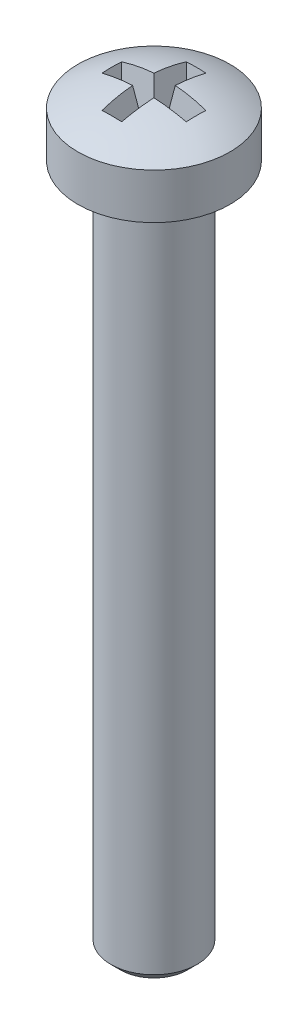
ISO-10303-21;
HEADER;
FILE_DESCRIPTION(('STEP AP214'),'2;1');
FILE_NAME('part.step','',(''),(''),'','','');
FILE_SCHEMA(('AUTOMOTIVE_DESIGN { 1 0 10303 214 1 1 1 1 }'));
ENDSEC;
DATA;
#1=APPLICATION_CONTEXT('core data for automotive mechanical design processes');
#2=APPLICATION_PROTOCOL_DEFINITION('international standard','automotive_design',2000,#1);
#3=PRODUCT_CONTEXT('',#1,'mechanical');
#4=PRODUCT('Part','Part','',(#3));
#5=PRODUCT_RELATED_PRODUCT_CATEGORY('part','',(#4));
#6=PRODUCT_DEFINITION_FORMATION('','',#4);
#7=PRODUCT_DEFINITION_CONTEXT('part definition',#1,'design');
#8=PRODUCT_DEFINITION('design','',#6,#7);
#9=PRODUCT_DEFINITION_SHAPE('','',#8);
#10=(LENGTH_UNIT() NAMED_UNIT(*) SI_UNIT(.MILLI.,.METRE.));
#11=(NAMED_UNIT(*) PLANE_ANGLE_UNIT() SI_UNIT($,.RADIAN.));
#12=(NAMED_UNIT(*) SI_UNIT($,.STERADIAN.) SOLID_ANGLE_UNIT());
#13=UNCERTAINTY_MEASURE_WITH_UNIT(LENGTH_MEASURE(1.E-05),#10,'distance_accuracy_value','');
#14=(GEOMETRIC_REPRESENTATION_CONTEXT(3) GLOBAL_UNCERTAINTY_ASSIGNED_CONTEXT((#13)) GLOBAL_UNIT_ASSIGNED_CONTEXT((#10,
#11,#12)) REPRESENTATION_CONTEXT('',''));
#15=CARTESIAN_POINT('',(0.,0.,0.));
#16=DIRECTION('',(0.,0.,1.));
#17=DIRECTION('',(1.,0.,0.));
#18=AXIS2_PLACEMENT_3D('',#15,#16,#17);
#19=CARTESIAN_POINT('',(5.7875,12.8,-2.45200000000001));
#20=DIRECTION('',(0.,-0.149438132473599,0.988771077936042));
#21=DIRECTION('',(-1.,0.,0.));
#22=AXIS2_PLACEMENT_3D('',#19,#20,#21);
#23=PLANE('',#22);
#24=CARTESIAN_POINT('',(6.00000000000001,9.74139917848052,-2.91426230211361));
#25=DIRECTION('',(0.,-0.149438132473599,0.988771077936042));
#26=DIRECTION('',(0.,0.988771077936042,0.149438132473599));
#27=AXIS2_PLACEMENT_3D('',#24,#25,#26);
#28=CIRCLE('',#27,2.97426048310416);
#29=CARTESIAN_POINT('',(6.19376146307785,12.6760147557736,-2.47073853692217));
#30=VERTEX_POINT('',#29);
#31=CARTESIAN_POINT('',(5.80623853692216,12.6760147557736,-2.47073853692217));
#32=VERTEX_POINT('',#31);
#33=EDGE_CURVE('E34',#30,#32,#28,.T.);
#34=ORIENTED_EDGE('',*,*,#33,.F.);
#35=DIRECTION('',(-0.14779696163853,-0.977912120929502,-0.14779696163853));
#36=VECTOR('',#35,1.);
#37=CARTESIAN_POINT('',(6.20785816235272,12.7692868564527,-2.45664183764729));
#38=LINE('',#37,#36);
#39=CARTESIAN_POINT('',(6.01602421652422,11.5,-2.6484757834758));
#40=VERTEX_POINT('',#39);
#41=EDGE_CURVE('E11',#30,#40,#38,.T.);
#42=ORIENTED_EDGE('',*,*,#41,.T.);
#43=DIRECTION('',(1.,0.,0.));
#44=VECTOR('',#43,1.);
#45=CARTESIAN_POINT('',(6.2125,11.5,-2.6484757834758));
#46=LINE('',#45,#44);
#47=CARTESIAN_POINT('',(5.98397578347579,11.5,-2.6484757834758));
#48=VERTEX_POINT('',#47);
#49=EDGE_CURVE('E168',#48,#40,#46,.T.);
#50=ORIENTED_EDGE('',*,*,#49,.F.);
#51=DIRECTION('',(0.14779696163853,-0.977912120929502,-0.14779696163853));
#52=VECTOR('',#51,1.);
#53=CARTESIAN_POINT('',(5.79446275647093,12.753930284679,-2.45896275647092));
#54=LINE('',#53,#52);
#55=EDGE_CURVE('E26',#32,#48,#54,.T.);
#56=ORIENTED_EDGE('',*,*,#55,.F.);
#57=EDGE_LOOP('',(#34,#42,#50,#56));
#58=FACE_BOUND('',#57,.T.);
#59=ADVANCED_FACE('F16',(#58),#23,.F.);
#60=CARTESIAN_POINT('',(5.7875,12.8,-3.08949999999999));
#61=DIRECTION('',(-0.988771077936042,-0.149438132473599,0.));
#62=DIRECTION('',(0.,0.,-1.));
#63=AXIS2_PLACEMENT_3D('',#60,#61,#62);
#64=PLANE('',#63);
#65=CARTESIAN_POINT('',(6.2355258080224,9.83559624435382,-3.302));
#66=DIRECTION('',(-0.988771077936042,-0.149438132473599,0.));
#67=DIRECTION('',(-0.149438132473599,0.988771077936042,0.));
#68=AXIS2_PLACEMENT_3D('',#65,#66,#67);
#69=CIRCLE('',#68,2.99052846519529);
#70=CARTESIAN_POINT('',(5.78973284200671,12.7852261965451,-3.09173284200673));
#71=VERTEX_POINT('',#70);
#72=EDGE_CURVE('E194',#32,#71,#69,.T.);
#73=ORIENTED_EDGE('',*,*,#72,.F.);
#74=ORIENTED_EDGE('',*,*,#55,.T.);
#75=DIRECTION('',(0.,0.,1.));
#76=VECTOR('',#75,1.);
#77=CARTESIAN_POINT('',(5.98397578347579,11.5,-2.45200000000001));
#78=LINE('',#77,#76);
#79=CARTESIAN_POINT('',(5.98397578347579,11.5,-3.28597578347578));
#80=VERTEX_POINT('',#79);
#81=EDGE_CURVE('E90',#80,#48,#78,.T.);
#82=ORIENTED_EDGE('',*,*,#81,.F.);
#83=DIRECTION('',(0.14779696163853,-0.977912120929502,-0.14779696163853));
#84=VECTOR('',#83,1.);
#85=CARTESIAN_POINT('',(5.78053724352907,12.846069715321,-3.08253724352908));
#86=LINE('',#85,#84);
#87=EDGE_CURVE('E218',#71,#80,#86,.T.);
#88=ORIENTED_EDGE('',*,*,#87,.F.);
#89=EDGE_LOOP('',(#73,#74,#82,#88));
#90=FACE_BOUND('',#89,.T.);
#91=ADVANCED_FACE('F244',(#90),#64,.F.);
#92=CARTESIAN_POINT('',(5.15,12.8,-3.08949999999999));
#93=DIRECTION('',(0.,-0.149438132473599,0.988771077936042));
#94=DIRECTION('',(-1.,0.,0.));
#95=AXIS2_PLACEMENT_3D('',#92,#93,#94);
#96=PLANE('',#95);
#97=CARTESIAN_POINT('',(6.00000000000001,9.83559624435382,-3.53752580802241));
#98=DIRECTION('',(0.,-0.149438132473599,0.988771077936042));
#99=DIRECTION('',(0.,0.988771077936042,0.149438132473599));
#100=AXIS2_PLACEMENT_3D('',#97,#98,#99);
#101=CIRCLE('',#100,2.99052846519529);
#102=CARTESIAN_POINT('',(5.16873853692217,12.6760147557736,-3.10823853692216));
#103=VERTEX_POINT('',#102);
#104=EDGE_CURVE('E191',#71,#103,#101,.T.);
#105=ORIENTED_EDGE('',*,*,#104,.F.);
#106=ORIENTED_EDGE('',*,*,#87,.T.);
#107=DIRECTION('',(1.,0.,0.));
#108=VECTOR('',#107,1.);
#109=CARTESIAN_POINT('',(5.7875,11.5,-3.28597578347578));
#110=LINE('',#109,#108);
#111=CARTESIAN_POINT('',(5.34647578347577,11.5,-3.28597578347578));
#112=VERTEX_POINT('',#111);
#113=EDGE_CURVE('E180',#112,#80,#110,.T.);
#114=ORIENTED_EDGE('',*,*,#113,.F.);
#115=DIRECTION('',(0.14779696163853,-0.977912120929502,-0.14779696163853));
#116=VECTOR('',#115,1.);
#117=CARTESIAN_POINT('',(5.15464183764729,12.7692868564527,-3.09414183764728));
#118=LINE('',#117,#116);
#119=EDGE_CURVE('E183',#103,#112,#118,.T.);
#120=ORIENTED_EDGE('',*,*,#119,.F.);
#121=EDGE_LOOP('',(#105,#106,#114,#120));
#122=FACE_BOUND('',#121,.T.);
#123=ADVANCED_FACE('F18',(#122),#96,.F.);
#124=CARTESIAN_POINT('',(5.15,12.8,-3.5145));
#125=DIRECTION('',(-0.988771077936042,-0.149438132473599,0.));
#126=DIRECTION('',(0.,0.,-1.));
#127=AXIS2_PLACEMENT_3D('',#124,#125,#126);
#128=PLANE('',#127);
#129=CARTESIAN_POINT('',(5.61226230211363,9.74139917848052,-3.302));
#130=DIRECTION('',(-0.988771077936042,-0.149438132473599,0.));
#131=DIRECTION('',(-0.149438132473599,0.988771077936042,0.));
#132=AXIS2_PLACEMENT_3D('',#129,#130,#131);
#133=CIRCLE('',#132,2.97426048310416);
#134=CARTESIAN_POINT('',(5.16873853692217,12.6760147557736,-3.49576146307784));
#135=VERTEX_POINT('',#134);
#136=EDGE_CURVE('E187',#103,#135,#133,.T.);
#137=ORIENTED_EDGE('',*,*,#136,.F.);
#138=ORIENTED_EDGE('',*,*,#119,.T.);
#139=DIRECTION('',(0.,0.,1.));
#140=VECTOR('',#139,1.);
#141=CARTESIAN_POINT('',(5.34647578347577,11.5,-3.08949999999999));
#142=LINE('',#141,#140);
#143=CARTESIAN_POINT('',(5.34647578347577,11.5,-3.31802421652422));
#144=VERTEX_POINT('',#143);
#145=EDGE_CURVE('E210',#144,#112,#142,.T.);
#146=ORIENTED_EDGE('',*,*,#145,.F.);
#147=DIRECTION('',(0.14779696163853,-0.977912120929502,0.14779696163853));
#148=VECTOR('',#147,1.);
#149=CARTESIAN_POINT('',(5.15696275647093,12.753930284679,-3.50753724352906));
#150=LINE('',#149,#148);
#151=EDGE_CURVE('E176',#135,#144,#150,.T.);
#152=ORIENTED_EDGE('',*,*,#151,.F.);
#153=EDGE_LOOP('',(#137,#138,#146,#152));
#154=FACE_BOUND('',#153,.T.);
#155=ADVANCED_FACE('F314',(#154),#128,.F.);
#156=CARTESIAN_POINT('',(5.7875,12.8,-3.5145));
#157=DIRECTION('',(0.,-0.149438132473599,-0.988771077936042));
#158=DIRECTION('',(1.,0.,0.));
#159=AXIS2_PLACEMENT_3D('',#156,#157,#158);
#160=PLANE('',#159);
#161=CARTESIAN_POINT('',(6.00000000000001,9.83559624435382,-3.06647419197759));
#162=DIRECTION('',(0.,-0.149438132473599,-0.988771077936042));
#163=DIRECTION('',(0.,-0.988771077936042,0.149438132473599));
#164=AXIS2_PLACEMENT_3D('',#161,#162,#163);
#165=CIRCLE('',#164,2.99052846519529);
#166=CARTESIAN_POINT('',(5.78973284200671,12.7852261965451,-3.5122671579933));
#167=VERTEX_POINT('',#166);
#168=EDGE_CURVE('E184',#135,#167,#165,.T.);
#169=ORIENTED_EDGE('',*,*,#168,.F.);
#170=ORIENTED_EDGE('',*,*,#151,.T.);
#171=DIRECTION('',(-1.,0.,0.));
#172=VECTOR('',#171,1.);
#173=CARTESIAN_POINT('',(5.15,11.5,-3.31802421652422));
#174=LINE('',#173,#172);
#175=CARTESIAN_POINT('',(5.98397578347579,11.5,-3.31802421652422));
#176=VERTEX_POINT('',#175);
#177=EDGE_CURVE('E209',#176,#144,#174,.T.);
#178=ORIENTED_EDGE('',*,*,#177,.F.);
#179=DIRECTION('',(0.14779696163853,-0.977912120929502,0.14779696163853));
#180=VECTOR('',#179,1.);
#181=CARTESIAN_POINT('',(5.78053724352907,12.846069715321,-3.52146275647092));
#182=LINE('',#181,#180);
#183=EDGE_CURVE('E174',#167,#176,#182,.T.);
#184=ORIENTED_EDGE('',*,*,#183,.F.);
#185=EDGE_LOOP('',(#169,#170,#178,#184));
#186=FACE_BOUND('',#185,.T.);
#187=ADVANCED_FACE('F277',(#186),#160,.F.);
#188=CARTESIAN_POINT('',(5.7875,12.8,-4.15199999999999));
#189=DIRECTION('',(-0.988771077936042,-0.149438132473599,0.));
#190=DIRECTION('',(0.,0.,-1.));
#191=AXIS2_PLACEMENT_3D('',#188,#189,#190);
#192=PLANE('',#191);
#193=CARTESIAN_POINT('',(6.2355258080224,9.83559624435382,-3.302));
#194=DIRECTION('',(-0.988771077936042,-0.149438132473599,0.));
#195=DIRECTION('',(-0.149438132473599,0.988771077936042,0.));
#196=AXIS2_PLACEMENT_3D('',#193,#194,#195);
#197=CIRCLE('',#196,2.99052846519529);
#198=CARTESIAN_POINT('',(5.80623853692216,12.6760147557736,-4.13326146307783));
#199=VERTEX_POINT('',#198);
#200=EDGE_CURVE('E188',#167,#199,#197,.T.);
#201=ORIENTED_EDGE('',*,*,#200,.F.);
#202=ORIENTED_EDGE('',*,*,#183,.T.);
#203=DIRECTION('',(0.,0.,1.));
#204=VECTOR('',#203,1.);
#205=CARTESIAN_POINT('',(5.98397578347579,11.5,-3.5145));
#206=LINE('',#205,#204);
#207=CARTESIAN_POINT('',(5.98397578347579,11.5,-3.9555242165242));
#208=VERTEX_POINT('',#207);
#209=EDGE_CURVE('E206',#208,#176,#206,.T.);
#210=ORIENTED_EDGE('',*,*,#209,.F.);
#211=DIRECTION('',(0.14779696163853,-0.977912120929502,0.14779696163853));
#212=VECTOR('',#211,1.);
#213=CARTESIAN_POINT('',(5.79214183764729,12.7692868564527,-4.1473581623527));
#214=LINE('',#213,#212);
#215=EDGE_CURVE('E177',#199,#208,#214,.T.);
#216=ORIENTED_EDGE('',*,*,#215,.F.);
#217=EDGE_LOOP('',(#201,#202,#210,#216));
#218=FACE_BOUND('',#217,.T.);
#219=ADVANCED_FACE('F273',(#218),#192,.F.);
#220=CARTESIAN_POINT('',(6.2125,12.8,-4.15199999999999));
#221=DIRECTION('',(0.,-0.149438132473599,-0.988771077936042));
#222=DIRECTION('',(1.,0.,0.));
#223=AXIS2_PLACEMENT_3D('',#220,#221,#222);
#224=PLANE('',#223);
#225=CARTESIAN_POINT('',(6.00000000000001,9.74139917848052,-3.68973769788639));
#226=DIRECTION('',(0.,-0.149438132473599,-0.988771077936042));
#227=DIRECTION('',(0.,-0.988771077936042,0.149438132473599));
#228=AXIS2_PLACEMENT_3D('',#225,#226,#227);
#229=CIRCLE('',#228,2.97426048310416);
#230=CARTESIAN_POINT('',(6.19376146307785,12.6760147557736,-4.13326146307783));
#231=VERTEX_POINT('',#230);
#232=EDGE_CURVE('E152',#199,#231,#229,.T.);
#233=ORIENTED_EDGE('',*,*,#232,.F.);
#234=ORIENTED_EDGE('',*,*,#215,.T.);
#235=DIRECTION('',(-1.,0.,0.));
#236=VECTOR('',#235,1.);
#237=CARTESIAN_POINT('',(5.7875,11.5,-3.9555242165242));
#238=LINE('',#237,#236);
#239=CARTESIAN_POINT('',(6.01602421652422,11.5,-3.9555242165242));
#240=VERTEX_POINT('',#239);
#241=EDGE_CURVE('E155',#240,#208,#238,.T.);
#242=ORIENTED_EDGE('',*,*,#241,.F.);
#243=DIRECTION('',(-0.14779696163853,-0.977912120929502,0.14779696163853));
#244=VECTOR('',#243,1.);
#245=CARTESIAN_POINT('',(6.20553724352907,12.753930284679,-4.14503724352908));
#246=LINE('',#245,#244);
#247=EDGE_CURVE('E167',#231,#240,#246,.T.);
#248=ORIENTED_EDGE('',*,*,#247,.F.);
#249=EDGE_LOOP('',(#233,#234,#242,#248));
#250=FACE_BOUND('',#249,.T.);
#251=ADVANCED_FACE('F276',(#250),#224,.F.);
#252=CARTESIAN_POINT('',(6.2125,12.8,-2.45200000000001));
#253=DIRECTION('',(0.988771077936042,-0.149438132473599,0.));
#254=DIRECTION('',(0.,0.,1.));
#255=AXIS2_PLACEMENT_3D('',#252,#253,#254);
#256=PLANE('',#255);
#257=CARTESIAN_POINT('',(5.76447419197759,9.83559624435382,-3.302));
#258=DIRECTION('',(0.988771077936042,-0.149438132473599,0.));
#259=DIRECTION('',(-0.149438132473599,-0.988771077936042,0.));
#260=AXIS2_PLACEMENT_3D('',#257,#258,#259);
#261=CIRCLE('',#260,2.99052846519529);
#262=CARTESIAN_POINT('',(6.21026715799329,12.7852261965451,-3.09173284200673));
#263=VERTEX_POINT('',#262);
#264=EDGE_CURVE('E160',#263,#30,#261,.T.);
#265=ORIENTED_EDGE('',*,*,#264,.F.);
#266=DIRECTION('',(-0.14779696163853,-0.977912120929502,-0.14779696163853));
#267=VECTOR('',#266,1.);
#268=CARTESIAN_POINT('',(6.21946275647092,12.846069715321,-3.08253724352908));
#269=LINE('',#268,#267);
#270=CARTESIAN_POINT('',(6.01602421652422,11.5,-3.28597578347578));
#271=VERTEX_POINT('',#270);
#272=EDGE_CURVE('E299',#263,#271,#269,.T.);
#273=ORIENTED_EDGE('',*,*,#272,.T.);
#274=DIRECTION('',(0.,0.,-1.));
#275=VECTOR('',#274,1.);
#276=CARTESIAN_POINT('',(6.01602421652422,11.5,-3.08949999999999));
#277=LINE('',#276,#275);
#278=EDGE_CURVE('E170',#40,#271,#277,.T.);
#279=ORIENTED_EDGE('',*,*,#278,.F.);
#280=ORIENTED_EDGE('',*,*,#41,.F.);
#281=EDGE_LOOP('',(#265,#273,#279,#280));
#282=FACE_BOUND('',#281,.T.);
#283=ADVANCED_FACE('F257',(#282),#256,.F.);
#284=CARTESIAN_POINT('',(6.2125,12.8,-3.08949999999999));
#285=DIRECTION('',(0.,-0.149438132473599,0.988771077936042));
#286=DIRECTION('',(-1.,0.,0.));
#287=AXIS2_PLACEMENT_3D('',#284,#285,#286);
#288=PLANE('',#287);
#289=CARTESIAN_POINT('',(6.00000000000001,9.83559624435382,-3.53752580802241));
#290=DIRECTION('',(0.,-0.149438132473599,0.988771077936042));
#291=DIRECTION('',(0.,0.988771077936042,0.149438132473599));
#292=AXIS2_PLACEMENT_3D('',#289,#290,#291);
#293=CIRCLE('',#292,2.99052846519529);
#294=CARTESIAN_POINT('',(6.83126146307784,12.6760147557736,-3.10823853692216));
#295=VERTEX_POINT('',#294);
#296=EDGE_CURVE('E157',#295,#263,#293,.T.);
#297=ORIENTED_EDGE('',*,*,#296,.F.);
#298=DIRECTION('',(-0.14779696163853,-0.977912120929502,-0.14779696163853));
#299=VECTOR('',#298,1.);
#300=CARTESIAN_POINT('',(6.84303724352907,12.753930284679,-3.09646275647094));
#301=LINE('',#300,#299);
#302=CARTESIAN_POINT('',(6.65352421652422,11.5,-3.28597578347578));
#303=VERTEX_POINT('',#302);
#304=EDGE_CURVE('E145',#295,#303,#301,.T.);
#305=ORIENTED_EDGE('',*,*,#304,.T.);
#306=DIRECTION('',(1.,0.,0.));
#307=VECTOR('',#306,1.);
#308=CARTESIAN_POINT('',(6.85,11.5,-3.28597578347578));
#309=LINE('',#308,#307);
#310=EDGE_CURVE('E138',#271,#303,#309,.T.);
#311=ORIENTED_EDGE('',*,*,#310,.F.);
#312=ORIENTED_EDGE('',*,*,#272,.F.);
#313=EDGE_LOOP('',(#297,#305,#311,#312));
#314=FACE_BOUND('',#313,.T.);
#315=ADVANCED_FACE('F254',(#314),#288,.F.);
#316=CARTESIAN_POINT('',(6.85,12.8,-3.08949999999999));
#317=DIRECTION('',(0.988771077936042,-0.149438132473599,0.));
#318=DIRECTION('',(0.,0.,1.));
#319=AXIS2_PLACEMENT_3D('',#316,#317,#318);
#320=PLANE('',#319);
#321=CARTESIAN_POINT('',(6.38773769788636,9.74139917848052,-3.302));
#322=DIRECTION('',(0.988771077936042,-0.149438132473599,0.));
#323=DIRECTION('',(-0.149438132473599,-0.988771077936042,0.));
#324=AXIS2_PLACEMENT_3D('',#321,#322,#323);
#325=CIRCLE('',#324,2.97426048310416);
#326=CARTESIAN_POINT('',(6.83126146307784,12.6760147557736,-3.49576146307784));
#327=VERTEX_POINT('',#326);
#328=EDGE_CURVE('E124',#327,#295,#325,.T.);
#329=ORIENTED_EDGE('',*,*,#328,.F.);
#330=DIRECTION('',(-0.14779696163853,-0.977912120929502,0.14779696163853));
#331=VECTOR('',#330,1.);
#332=CARTESIAN_POINT('',(6.84535816235271,12.7692868564527,-3.50985816235272));
#333=LINE('',#332,#331);
#334=CARTESIAN_POINT('',(6.65352421652422,11.5,-3.31802421652422));
#335=VERTEX_POINT('',#334);
#336=EDGE_CURVE('E141',#327,#335,#333,.T.);
#337=ORIENTED_EDGE('',*,*,#336,.T.);
#338=DIRECTION('',(0.,0.,-1.));
#339=VECTOR('',#338,1.);
#340=CARTESIAN_POINT('',(6.65352421652422,11.5,-3.5145));
#341=LINE('',#340,#339);
#342=EDGE_CURVE('E129',#303,#335,#341,.T.);
#343=ORIENTED_EDGE('',*,*,#342,.F.);
#344=ORIENTED_EDGE('',*,*,#304,.F.);
#345=EDGE_LOOP('',(#329,#337,#343,#344));
#346=FACE_BOUND('',#345,.T.);
#347=ADVANCED_FACE('F142',(#346),#320,.F.);
#348=CARTESIAN_POINT('',(6.85,12.8,-3.5145));
#349=DIRECTION('',(0.,-0.149438132473599,-0.988771077936042));
#350=DIRECTION('',(1.,0.,0.));
#351=AXIS2_PLACEMENT_3D('',#348,#349,#350);
#352=PLANE('',#351);
#353=CARTESIAN_POINT('',(6.00000000000001,9.83559624435382,-3.06647419197759));
#354=DIRECTION('',(0.,-0.149438132473599,-0.988771077936042));
#355=DIRECTION('',(0.,-0.988771077936042,0.149438132473599));
#356=AXIS2_PLACEMENT_3D('',#353,#354,#355);
#357=CIRCLE('',#356,2.99052846519529);
#358=CARTESIAN_POINT('',(6.21026715799329,12.7852261965451,-3.5122671579933));
#359=VERTEX_POINT('',#358);
#360=EDGE_CURVE('E171',#359,#327,#357,.T.);
#361=ORIENTED_EDGE('',*,*,#360,.F.);
#362=DIRECTION('',(-0.14779696163853,-0.977912120929502,0.14779696163853));
#363=VECTOR('',#362,1.);
#364=CARTESIAN_POINT('',(6.21946275647092,12.846069715321,-3.52146275647092));
#365=LINE('',#364,#363);
#366=CARTESIAN_POINT('',(6.01602421652422,11.5,-3.31802421652422));
#367=VERTEX_POINT('',#366);
#368=EDGE_CURVE('E146',#359,#367,#365,.T.);
#369=ORIENTED_EDGE('',*,*,#368,.T.);
#370=DIRECTION('',(-1.,0.,0.));
#371=VECTOR('',#370,1.);
#372=CARTESIAN_POINT('',(6.2125,11.5,-3.31802421652422));
#373=LINE('',#372,#371);
#374=EDGE_CURVE('E134',#335,#367,#373,.T.);
#375=ORIENTED_EDGE('',*,*,#374,.F.);
#376=ORIENTED_EDGE('',*,*,#336,.F.);
#377=EDGE_LOOP('',(#361,#369,#375,#376));
#378=FACE_BOUND('',#377,.T.);
#379=ADVANCED_FACE('F148',(#378),#352,.F.);
#380=CARTESIAN_POINT('',(6.2125,12.8,-3.5145));
#381=DIRECTION('',(0.988771077936042,-0.149438132473599,0.));
#382=DIRECTION('',(0.,0.,1.));
#383=AXIS2_PLACEMENT_3D('',#380,#381,#382);
#384=PLANE('',#383);
#385=CARTESIAN_POINT('',(5.76447419197759,9.83559624435382,-3.302));
#386=DIRECTION('',(0.988771077936042,-0.149438132473599,0.));
#387=DIRECTION('',(-0.149438132473599,-0.988771077936042,0.));
#388=AXIS2_PLACEMENT_3D('',#385,#386,#387);
#389=CIRCLE('',#388,2.99052846519529);
#390=EDGE_CURVE('E173',#231,#359,#389,.T.);
#391=ORIENTED_EDGE('',*,*,#390,.F.);
#392=ORIENTED_EDGE('',*,*,#247,.T.);
#393=DIRECTION('',(0.,0.,-1.));
#394=VECTOR('',#393,1.);
#395=CARTESIAN_POINT('',(6.01602421652422,11.5,-4.15199999999999));
#396=LINE('',#395,#394);
#397=EDGE_CURVE('E20',#367,#240,#396,.T.);
#398=ORIENTED_EDGE('',*,*,#397,.F.);
#399=ORIENTED_EDGE('',*,*,#368,.F.);
#400=EDGE_LOOP('',(#391,#392,#398,#399));
#401=FACE_BOUND('',#400,.T.);
#402=ADVANCED_FACE('F239',(#401),#384,.F.);
#403=CARTESIAN_POINT('',(6.00000000000001,11.5,-3.302));
#404=DIRECTION('',(0.,-1.,0.));
#405=DIRECTION('',(1.,0.,0.));
#406=AXIS2_PLACEMENT_3D('',#403,#404,#405);
#407=PLANE('',#406);
#408=ORIENTED_EDGE('',*,*,#241,.T.);
#409=ORIENTED_EDGE('',*,*,#209,.T.);
#410=ORIENTED_EDGE('',*,*,#177,.T.);
#411=ORIENTED_EDGE('',*,*,#145,.T.);
#412=ORIENTED_EDGE('',*,*,#113,.T.);
#413=ORIENTED_EDGE('',*,*,#81,.T.);
#414=ORIENTED_EDGE('',*,*,#49,.T.);
#415=ORIENTED_EDGE('',*,*,#278,.T.);
#416=ORIENTED_EDGE('',*,*,#310,.T.);
#417=ORIENTED_EDGE('',*,*,#342,.T.);
#418=ORIENTED_EDGE('',*,*,#374,.T.);
#419=ORIENTED_EDGE('',*,*,#397,.T.);
#420=EDGE_LOOP('',(#408,#409,#410,#411,#412,#413,#414,#415,#416,#417,#418,#419));
#421=FACE_BOUND('',#420,.T.);
#422=ADVANCED_FACE('F131',(#421),#407,.F.);
#423=CARTESIAN_POINT('',(6.00000000000001,9.8,-3.302));
#424=DIRECTION('',(-1.,0.,0.));
#425=DIRECTION('',(0.,-1.,0.));
#426=AXIS2_PLACEMENT_3D('',#423,#424,#425);
#427=SPHERICAL_SURFACE('',#426,3.);
#428=ORIENTED_EDGE('',*,*,#232,.T.);
#429=ORIENTED_EDGE('',*,*,#390,.T.);
#430=ORIENTED_EDGE('',*,*,#360,.T.);
#431=ORIENTED_EDGE('',*,*,#328,.T.);
#432=ORIENTED_EDGE('',*,*,#296,.T.);
#433=ORIENTED_EDGE('',*,*,#264,.T.);
#434=ORIENTED_EDGE('',*,*,#33,.T.);
#435=ORIENTED_EDGE('',*,*,#72,.T.);
#436=ORIENTED_EDGE('',*,*,#104,.T.);
#437=ORIENTED_EDGE('',*,*,#136,.T.);
#438=ORIENTED_EDGE('',*,*,#168,.T.);
#439=ORIENTED_EDGE('',*,*,#200,.T.);
#440=EDGE_LOOP('',(#428,#429,#430,#431,#432,#433,#434,#435,#436,#437,#438,#439));
#441=FACE_BOUND('',#440,.T.);
#442=CARTESIAN_POINT('',(6.00000000000001,12.3980762113533,-3.302));
#443=DIRECTION('',(0.,-1.,0.));
#444=DIRECTION('',(0.,0.,1.));
#445=AXIS2_PLACEMENT_3D('',#442,#443,#444);
#446=CIRCLE('',#445,1.5);
#447=CARTESIAN_POINT('',(6.00000000000001,12.3980762113533,-1.802));
#448=VERTEX_POINT('',#447);
#449=EDGE_CURVE('E190',#448,#448,#446,.T.);
#450=ORIENTED_EDGE('',*,*,#449,.F.);
#451=EDGE_LOOP('',(#450));
#452=FACE_BOUND('',#451,.T.);
#453=ADVANCED_FACE('F228',(#441,#452),#427,.T.);
#454=CARTESIAN_POINT('',(6.00000000000001,11.9490381056767,-3.302));
#455=DIRECTION('',(0.,1.,0.));
#456=DIRECTION('',(0.,0.,1.));
#457=AXIS2_PLACEMENT_3D('',#454,#455,#456);
#458=CYLINDRICAL_SURFACE('',#457,1.5);
#459=CARTESIAN_POINT('',(6.00000000000001,11.5,-3.302));
#460=DIRECTION('',(0.,-1.,0.));
#461=DIRECTION('',(0.,0.,1.));
#462=AXIS2_PLACEMENT_3D('',#459,#460,#461);
#463=CIRCLE('',#462,1.5);
#464=CARTESIAN_POINT('',(6.00000000000001,11.5,-1.802));
#465=VERTEX_POINT('',#464);
#466=EDGE_CURVE('E164',#465,#465,#463,.T.);
#467=ORIENTED_EDGE('',*,*,#466,.F.);
#468=EDGE_LOOP('',(#467));
#469=FACE_BOUND('',#468,.T.);
#470=ORIENTED_EDGE('',*,*,#449,.T.);
#471=EDGE_LOOP('',(#470));
#472=FACE_BOUND('',#471,.T.);
#473=ADVANCED_FACE('F226',(#469,#472),#458,.T.);
#474=CARTESIAN_POINT('',(6.00000000000001,11.5,-2.077));
#475=DIRECTION('',(0.,-1.,0.));
#476=DIRECTION('',(0.,0.,1.));
#477=AXIS2_PLACEMENT_3D('',#474,#475,#476);
#478=PLANE('',#477);
#479=CARTESIAN_POINT('',(6.00000000000001,11.5,-3.302));
#480=DIRECTION('',(0.,-1.,0.));
#481=DIRECTION('',(0.,0.,1.));
#482=AXIS2_PLACEMENT_3D('',#479,#480,#481);
#483=CIRCLE('',#482,0.95);
#484=CARTESIAN_POINT('',(6.00000000000001,11.5,-2.35199999999999));
#485=VERTEX_POINT('',#484);
#486=EDGE_CURVE('E161',#485,#485,#483,.T.);
#487=ORIENTED_EDGE('',*,*,#486,.F.);
#488=EDGE_LOOP('',(#487));
#489=FACE_BOUND('',#488,.T.);
#490=ORIENTED_EDGE('',*,*,#466,.T.);
#491=EDGE_LOOP('',(#490));
#492=FACE_BOUND('',#491,.T.);
#493=ADVANCED_FACE('F236',(#489,#492),#478,.T.);
#494=CARTESIAN_POINT('',(6.00000000000001,11.4,-3.302));
#495=DIRECTION('',(0.,-1.,0.));
#496=DIRECTION('',(1.,0.,0.));
#497=AXIS2_PLACEMENT_3D('',#494,#495,#496);
#498=TOROIDAL_SURFACE('',#497,0.95,0.1);
#499=CARTESIAN_POINT('',(6.00000000000001,11.4,-3.302));
#500=DIRECTION('',(0.,-1.,0.));
#501=DIRECTION('',(0.,0.,1.));
#502=AXIS2_PLACEMENT_3D('',#499,#500,#501);
#503=CIRCLE('',#502,0.85);
#504=CARTESIAN_POINT('',(6.00000000000001,11.4,-2.45200000000001));
#505=VERTEX_POINT('',#504);
#506=EDGE_CURVE('E165',#505,#505,#503,.T.);
#507=ORIENTED_EDGE('',*,*,#506,.F.);
#508=EDGE_LOOP('',(#507));
#509=FACE_BOUND('',#508,.T.);
#510=ORIENTED_EDGE('',*,*,#486,.T.);
#511=EDGE_LOOP('',(#510));
#512=FACE_BOUND('',#511,.T.);
#513=ADVANCED_FACE('F262',(#509,#512),#498,.F.);
#514=CARTESIAN_POINT('',(6.00000000000001,4.79471875000001,-3.302));
#515=DIRECTION('',(0.,1.,0.));
#516=DIRECTION('',(0.,0.,1.));
#517=AXIS2_PLACEMENT_3D('',#514,#515,#516);
#518=CYLINDRICAL_SURFACE('',#517,0.85);
#519=CARTESIAN_POINT('',(6.00000000000001,-1.8105625,-3.302));
#520=DIRECTION('',(0.,-1.,0.));
#521=DIRECTION('',(0.,0.,1.));
#522=AXIS2_PLACEMENT_3D('',#519,#520,#521);
#523=CIRCLE('',#522,0.85);
#524=CARTESIAN_POINT('',(6.00000000000001,-1.8105625,-2.45200000000001));
#525=VERTEX_POINT('',#524);
#526=EDGE_CURVE('E222',#525,#525,#523,.T.);
#527=ORIENTED_EDGE('',*,*,#526,.F.);
#528=EDGE_LOOP('',(#527));
#529=FACE_BOUND('',#528,.T.);
#530=ORIENTED_EDGE('',*,*,#506,.T.);
#531=EDGE_LOOP('',(#530));
#532=FACE_BOUND('',#531,.T.);
#533=ADVANCED_FACE('F251',(#529,#532),#518,.T.);
#534=CARTESIAN_POINT('',(6.00000000000001,-1.90528125,-3.302));
#535=DIRECTION('',(0.,1.,0.));
#536=DIRECTION('',(0.,0.,1.));
#537=AXIS2_PLACEMENT_3D('',#534,#535,#536);
#538=CONICAL_SURFACE('',#537,0.75528125,0.785398163397448);
#539=CARTESIAN_POINT('',(6.00000000000001,-2.,-3.302));
#540=DIRECTION('',(0.,-1.,0.));
#541=DIRECTION('',(0.,0.,1.));
#542=AXIS2_PLACEMENT_3D('',#539,#540,#541);
#543=CIRCLE('',#542,0.6605625);
#544=CARTESIAN_POINT('',(6.00000000000001,-2.,-2.64143750000001));
#545=VERTEX_POINT('',#544);
#546=EDGE_CURVE('E292',#545,#545,#543,.T.);
#547=ORIENTED_EDGE('',*,*,#546,.F.);
#548=EDGE_LOOP('',(#547));
#549=FACE_BOUND('',#548,.T.);
#550=ORIENTED_EDGE('',*,*,#526,.T.);
#551=EDGE_LOOP('',(#550));
#552=FACE_BOUND('',#551,.T.);
#553=ADVANCED_FACE('F271',(#549,#552),#538,.T.);
#554=CARTESIAN_POINT('',(6.00000000000001,-2.,-2.97171874999999));
#555=DIRECTION('',(0.,-1.,0.));
#556=DIRECTION('',(0.,0.,1.));
#557=AXIS2_PLACEMENT_3D('',#554,#555,#556);
#558=PLANE('',#557);
#559=ORIENTED_EDGE('',*,*,#546,.T.);
#560=EDGE_LOOP('',(#559));
#561=FACE_BOUND('',#560,.T.);
#562=ADVANCED_FACE('F268',(#561),#558,.T.);
#563=CLOSED_SHELL('',(#59,#91,#123,#155,#187,#219,#251,#283,#315,#347,#379,#402,#422,#453,#473,
#493,#513,#533,#553,#562));
#564=MANIFOLD_SOLID_BREP('B1',#563);
#565=ADVANCED_BREP_SHAPE_REPRESENTATION('',(#18,#564),#14);
#566=SHAPE_DEFINITION_REPRESENTATION(#9,#565);
ENDSEC;
END-ISO-10303-21;
